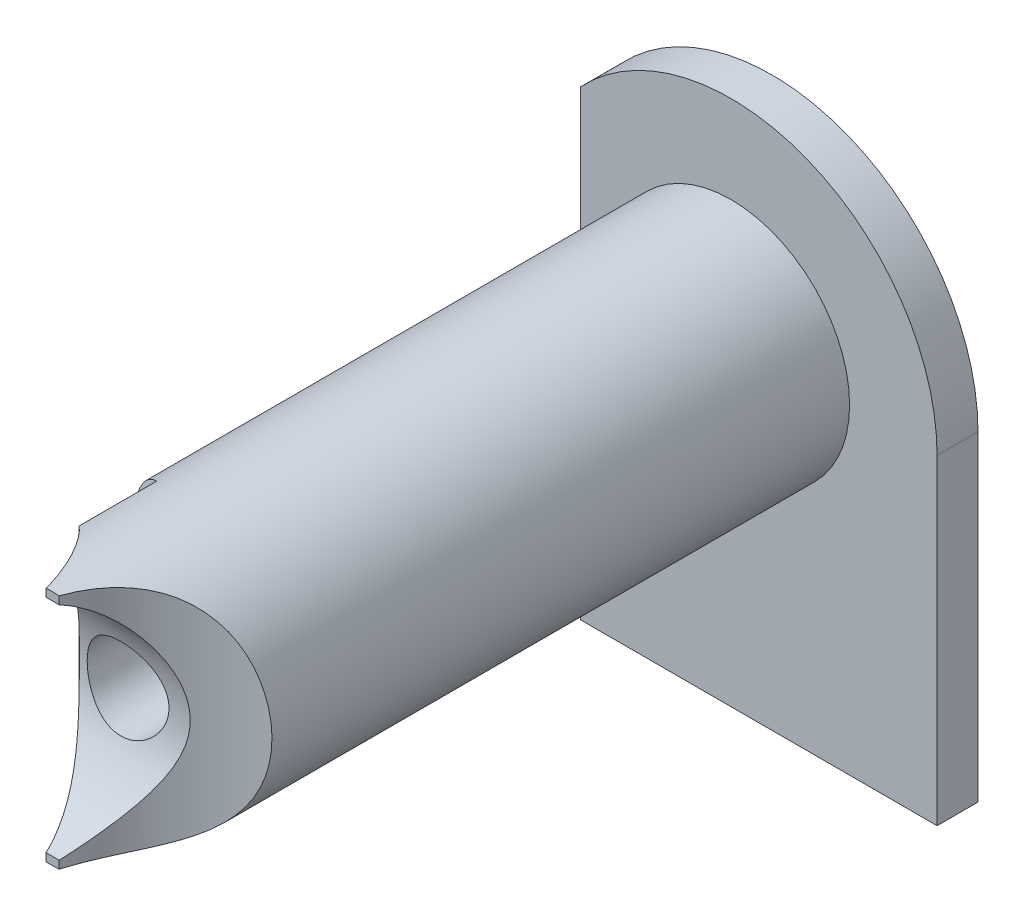
ISO-10303-21;
HEADER;
FILE_DESCRIPTION(('STEP AP214'),'2;1');
FILE_NAME('part.step','',(''),(''),'','','');
FILE_SCHEMA(('AUTOMOTIVE_DESIGN { 1 0 10303 214 1 1 1 1 }'));
ENDSEC;
DATA;
#1=APPLICATION_CONTEXT('core data for automotive mechanical design processes');
#2=APPLICATION_PROTOCOL_DEFINITION('international standard','automotive_design',2000,#1);
#3=PRODUCT_CONTEXT('',#1,'mechanical');
#4=PRODUCT('Part','Part','',(#3));
#5=PRODUCT_RELATED_PRODUCT_CATEGORY('part','',(#4));
#6=PRODUCT_DEFINITION_FORMATION('','',#4);
#7=PRODUCT_DEFINITION_CONTEXT('part definition',#1,'design');
#8=PRODUCT_DEFINITION('design','',#6,#7);
#9=PRODUCT_DEFINITION_SHAPE('','',#8);
#10=(LENGTH_UNIT() NAMED_UNIT(*) SI_UNIT(.MILLI.,.METRE.));
#11=(NAMED_UNIT(*) PLANE_ANGLE_UNIT() SI_UNIT($,.RADIAN.));
#12=(NAMED_UNIT(*) SI_UNIT($,.STERADIAN.) SOLID_ANGLE_UNIT());
#13=UNCERTAINTY_MEASURE_WITH_UNIT(LENGTH_MEASURE(1.E-05),#10,'distance_accuracy_value','');
#14=(GEOMETRIC_REPRESENTATION_CONTEXT(3) GLOBAL_UNCERTAINTY_ASSIGNED_CONTEXT((#13)) GLOBAL_UNIT_ASSIGNED_CONTEXT((#10,
#11,#12)) REPRESENTATION_CONTEXT('',''));
#15=CARTESIAN_POINT('',(0.,0.,0.));
#16=DIRECTION('',(0.,0.,1.));
#17=DIRECTION('',(1.,0.,0.));
#18=AXIS2_PLACEMENT_3D('',#15,#16,#17);
#19=CARTESIAN_POINT('',(0.,0.,0.));
#20=DIRECTION('',(0.,0.,1.));
#21=DIRECTION('',(1.,0.,0.));
#22=AXIS2_PLACEMENT_3D('',#19,#20,#21);
#23=CYLINDRICAL_SURFACE('',#22,2.2);
#24=CARTESIAN_POINT('',(0.,0.,1.39999999998963));
#25=DIRECTION('',(0.,0.,-1.));
#26=DIRECTION('',(1.,0.,0.));
#27=AXIS2_PLACEMENT_3D('',#24,#25,#26);
#28=CIRCLE('',#27,2.20000000007303);
#29=CARTESIAN_POINT('',(2.20000000007303,0.,1.39999999998963));
#30=VERTEX_POINT('',#29);
#31=EDGE_CURVE('E156',#30,#30,#28,.T.);
#32=ORIENTED_EDGE('',*,*,#31,.T.);
#33=EDGE_LOOP('',(#32));
#34=FACE_BOUND('',#33,.T.);
#35=CARTESIAN_POINT('',(0.,0.,16.));
#36=DIRECTION('',(0.,0.,1.));
#37=DIRECTION('',(1.,0.,0.));
#38=AXIS2_PLACEMENT_3D('',#35,#36,#37);
#39=CIRCLE('',#38,2.2);
#40=CARTESIAN_POINT('',(2.2,0.,16.));
#41=VERTEX_POINT('',#40);
#42=EDGE_CURVE('E19',#41,#41,#39,.T.);
#43=ORIENTED_EDGE('',*,*,#42,.T.);
#44=EDGE_LOOP('',(#43));
#45=FACE_BOUND('',#44,.T.);
#46=ADVANCED_FACE('F16',(#34,#45),#23,.F.);
#47=CARTESIAN_POINT('',(0.,0.,16.));
#48=DIRECTION('',(0.,0.,1.));
#49=DIRECTION('',(1.,0.,0.));
#50=AXIS2_PLACEMENT_3D('',#47,#48,#49);
#51=PLANE('',#50);
#52=CARTESIAN_POINT('',(0.,0.,16.));
#53=DIRECTION('',(0.,0.,-1.));
#54=DIRECTION('',(-1.,0.,0.));
#55=AXIS2_PLACEMENT_3D('',#52,#53,#54);
#56=CIRCLE('',#55,1.25);
#57=CARTESIAN_POINT('',(-1.25,0.,16.));
#58=VERTEX_POINT('',#57);
#59=EDGE_CURVE('E159',#58,#58,#56,.F.);
#60=ORIENTED_EDGE('',*,*,#59,.T.);
#61=EDGE_LOOP('',(#60));
#62=FACE_BOUND('',#61,.T.);
#63=ORIENTED_EDGE('',*,*,#42,.F.);
#64=EDGE_LOOP('',(#63));
#65=FACE_BOUND('',#64,.T.);
#66=ADVANCED_FACE('F246',(#62,#65),#51,.F.);
#67=CARTESIAN_POINT('',(0.,0.,5.6843418860808E-11));
#68=DIRECTION('',(0.,0.,-1.));
#69=DIRECTION('',(-1.,0.,0.));
#70=AXIS2_PLACEMENT_3D('',#67,#68,#69);
#71=CONICAL_SURFACE('',#70,3.60000000000582,0.785398163397448);
#72=CARTESIAN_POINT('',(0.,0.,5.6843418860808E-11));
#73=DIRECTION('',(0.,0.,-1.));
#74=DIRECTION('',(-1.,0.,0.));
#75=AXIS2_PLACEMENT_3D('',#72,#73,#74);
#76=CIRCLE('',#75,3.60000000000582);
#77=CARTESIAN_POINT('',(-3.60000000000582,0.,5.6843418860808E-11));
#78=VERTEX_POINT('',#77);
#79=EDGE_CURVE('E141',#78,#78,#76,.T.);
#80=ORIENTED_EDGE('',*,*,#79,.T.);
#81=EDGE_LOOP('',(#80));
#82=FACE_BOUND('',#81,.T.);
#83=ORIENTED_EDGE('',*,*,#31,.F.);
#84=EDGE_LOOP('',(#83));
#85=FACE_BOUND('',#84,.T.);
#86=ADVANCED_FACE('F243',(#82,#85),#71,.F.);
#87=CARTESIAN_POINT('',(0.,0.,22.));
#88=DIRECTION('',(0.,0.,-1.));
#89=DIRECTION('',(-1.,0.,0.));
#90=AXIS2_PLACEMENT_3D('',#87,#88,#89);
#91=CYLINDRICAL_SURFACE('',#90,1.25);
#92=ORIENTED_EDGE('',*,*,#59,.F.);
#93=EDGE_LOOP('',(#92));
#94=FACE_BOUND('',#93,.T.);
#95=CARTESIAN_POINT('',(0.,1.25,19.8978436713564));
#96=CARTESIAN_POINT('',(-0.0679244800988479,1.25000086796655,19.8978443860581));
#97=CARTESIAN_POINT('',(-0.135842933793422,1.24444487050265,19.8957833530326));
#98=CARTESIAN_POINT('',(-0.269657575517761,1.22244980443124,19.8878088146394));
#99=CARTESIAN_POINT('',(-0.335553550477822,1.20600959325332,19.881894904817));
#100=CARTESIAN_POINT('',(-0.463360945324166,1.16290062835713,19.8669627047752));
#101=CARTESIAN_POINT('',(-0.525280337329512,1.13625313605356,19.8579508713991));
#102=CARTESIAN_POINT('',(-0.643791152118634,1.07355949262704,19.837847899369));
#103=CARTESIAN_POINT('',(-0.700381263501824,1.03751103634852,19.8267562509232));
#104=CARTESIAN_POINT('',(-0.809007347203373,0.955414579593332,19.8032203151329));
#105=CARTESIAN_POINT('',(-0.860786737513333,0.909037171034703,19.7907405403483));
#106=CARTESIAN_POINT('',(-0.956009639956803,0.808301154152748,19.766133329688));
#107=CARTESIAN_POINT('',(-0.999451698829062,0.753941157312231,19.7540059555505));
#108=CARTESIAN_POINT('',(-1.07795080960379,0.636886846726681,19.7310560526318));
#109=CARTESIAN_POINT('',(-1.11273621101807,0.574000420441734,19.7202800833318));
#110=CARTESIAN_POINT('',(-1.17113157115788,0.442831894091509,19.701667612356));
#111=CARTESIAN_POINT('',(-1.19474477999888,0.374551369983123,19.6938302559428));
#112=CARTESIAN_POINT('',(-1.2292470985948,0.237225190263073,19.6822295733358));
#113=CARTESIAN_POINT('',(-1.24057636261075,0.16830221771519,19.678325699712));
#114=CARTESIAN_POINT('',(-1.25159174102537,0.0294302907076386,19.6745314082797));
#115=CARTESIAN_POINT('',(-1.25128107389356,-0.0405183747982762,19.6746398810475));
#116=CARTESIAN_POINT('',(-1.23929822635911,-0.176329706572923,19.6787644389511));
#117=CARTESIAN_POINT('',(-1.22810474950267,-0.242240442098288,19.6826158787156));
#118=CARTESIAN_POINT('',(-1.19546944676986,-0.371182833738493,19.6935843230476));
#119=CARTESIAN_POINT('',(-1.17402691447761,-0.434214291071031,19.7007015527082));
#120=CARTESIAN_POINT('',(-1.12123918718876,-0.556620898055839,19.7176047832685));
#121=CARTESIAN_POINT('',(-1.08976314845211,-0.61593458665218,19.7274257985207));
#122=CARTESIAN_POINT('',(-1.01791174395466,-0.728575193755699,19.7487221659081));
#123=CARTESIAN_POINT('',(-0.977533779711246,-0.781900357331002,19.760198000748));
#124=CARTESIAN_POINT('',(-0.886641267506775,-0.883891513879295,19.7842833845292));
#125=CARTESIAN_POINT('',(-0.8357188282652,-0.932187934326669,19.7969209237661));
#126=CARTESIAN_POINT('',(-0.726397770707999,-1.01968084494647,19.8214254442492));
#127=CARTESIAN_POINT('',(-0.66799781853852,-1.05887570804644,19.8332922874464));
#128=CARTESIAN_POINT('',(-0.544129319151011,-1.12761669610327,19.8550717885169));
#129=CARTESIAN_POINT('',(-0.478561028872439,-1.15699504567843,19.8649494215703));
#130=CARTESIAN_POINT('',(-0.342979508718129,-1.20416381175255,19.8812278361306));
#131=CARTESIAN_POINT('',(-0.272968324636218,-1.22195951975829,19.8876302050829));
#132=CARTESIAN_POINT('',(-0.134090244649073,-1.24468095728118,19.8958697798906));
#133=CARTESIAN_POINT('',(-0.065329920620134,-1.25018382842495,19.897911498419));
#134=CARTESIAN_POINT('',(0.0721472888909036,-1.24980687642328,19.8977724226291));
#135=CARTESIAN_POINT('',(0.140864180299875,-1.24392932217262,19.8955924699776));
#136=CARTESIAN_POINT('',(0.273588572060938,-1.22147843143933,19.8874606833778));
#137=CARTESIAN_POINT('',(0.337675880725648,-1.20531827758905,19.8816547123743));
#138=CARTESIAN_POINT('',(0.462212228709352,-1.16326336828004,19.8670890804522));
#139=CARTESIAN_POINT('',(0.522660591188891,-1.13736680831216,19.8583288720372));
#140=CARTESIAN_POINT('',(0.640446216933245,-1.07559215860392,19.838479568612));
#141=CARTESIAN_POINT('',(0.69761176173089,-1.03940914354079,19.8273223701759));
#142=CARTESIAN_POINT('',(0.80526753647923,-0.958428141299509,19.8040632405038));
#143=CARTESIAN_POINT('',(0.855755651824465,-0.913627436046384,19.7919610119165));
#144=CARTESIAN_POINT('',(0.951354636496911,-0.813903923966883,19.7674102209685));
#145=CARTESIAN_POINT('',(0.996046346298425,-0.758574360910484,19.7549766337844));
#146=CARTESIAN_POINT('',(1.07554433194323,-0.640894131740424,19.7317831377029));
#147=CARTESIAN_POINT('',(1.11035087446422,-0.578543655097271,19.7210231836585));
#148=CARTESIAN_POINT('',(1.16878954928363,-0.448840953661153,19.7024299594336));
#149=CARTESIAN_POINT('',(1.19248711414304,-0.381520791166974,19.6945796103623));
#150=CARTESIAN_POINT('',(1.22811609579468,-0.243523290194956,19.6826186057761));
#151=CARTESIAN_POINT('',(1.24005211170052,-0.172847275295524,19.6785064885507));
#152=CARTESIAN_POINT('',(1.25138151325684,-0.0339646408415084,19.6746036325415));
#153=CARTESIAN_POINT('',(1.25137467368776,0.0341877486817581,19.674606249536));
#154=CARTESIAN_POINT('',(1.24031579157669,0.169475270760439,19.6784153912838));
#155=CARTESIAN_POINT('',(1.22926475952144,0.236610495810688,19.6822215680309));
#156=CARTESIAN_POINT('',(1.19683703997043,0.366739710113705,19.6931287184379));
#157=CARTESIAN_POINT('',(1.17565097385536,0.429786678559307,19.7001687752202));
#158=CARTESIAN_POINT('',(1.12373438064327,0.551450801547351,19.7168175975318));
#159=CARTESIAN_POINT('',(1.09300209006457,0.610067135125508,19.7264268376227));
#160=CARTESIAN_POINT('',(1.02150459005946,0.72367495976101,19.7476932825457));
#161=CARTESIAN_POINT('',(0.980398025175527,0.7784393292172,19.7594152000636));
#162=CARTESIAN_POINT('',(0.889887080709123,0.880486113485907,19.7834460652259));
#163=CARTESIAN_POINT('',(0.840479956379136,0.92776604334017,19.7957552060804));
#164=CARTESIAN_POINT('',(0.732239723477382,1.01557160693506,19.8202070041386));
#165=CARTESIAN_POINT('',(0.673093154621859,1.05572043580642,19.8323198618095));
#166=CARTESIAN_POINT('',(0.548510903251562,1.1254910455994,19.8543727114239));
#167=CARTESIAN_POINT('',(0.483076273882375,1.15511458544152,19.8643130663155));
#168=CARTESIAN_POINT('',(0.349091955921276,1.20232010017759,19.8805798993618));
#169=CARTESIAN_POINT('',(0.280634096711385,1.22013735783424,19.8869765451443));
#170=CARTESIAN_POINT('',(0.141448006087147,1.24397438925929,19.8956071887561));
#171=CARTESIAN_POINT('',(0.0707207366450371,1.24999909630175,19.8978429272324));
#172=CARTESIAN_POINT('',(0.,1.25,19.8978436713564));
#173=B_SPLINE_CURVE_WITH_KNOTS('',3,(#95,#96,#97,#98,#99,#100,#101,#102,#103,#104,#105,#106,
#107,#108,#109,#110,#111,#112,#113,#114,#115,#116,#117,#118,#119,#120,#121,#122,#123,#124,#125,
#126,#127,#128,#129,#130,#131,#132,#133,#134,#135,#136,#137,#138,#139,#140,#141,#142,#143,#144,
#145,#146,#147,#148,#149,#150,#151,#152,#153,#154,#155,#156,#157,#158,#159,#160,#161,#162,#163,
#164,#165,#166,#167,#168,#169,#170,#171,#172),.UNSPECIFIED.,.T.,.F.,(4,2,2,2,2,2,2,2,2,2,2,2,2,
2,2,2,2,2,2,2,2,2,2,2,2,2,2,2,2,2,2,2,2,2,2,2,2,2,4),(0.,0.203511139491736,0.407043645954993,
0.610154486559866,0.813315177694251,1.02423741599598,1.23519638634716,1.45211698254992,
1.66897443527126,1.87777478156237,2.08651739447182,2.28647500077357,2.48644639113581,
2.68914025789089,2.89189336974925,3.1048510057456,3.31784668261728,3.53431589010938,
3.75068613453101,3.95666316344897,4.16259913132811,4.36074177300059,4.55892115580724,
4.7637300924964,4.96860373347955,5.18418899640245,5.3997684428082,5.61406164396909,
5.8282710168564,6.03172303865505,6.23515644734529,6.43490568970265,6.63469185386391,
6.84218649561138,7.04974988518443,7.26621834146235,7.4826506058514,7.69462841418539,
7.90651752514187),.UNSPECIFIED.);
#174=CARTESIAN_POINT('',(0.,1.25,19.8978436713564));
#175=VERTEX_POINT('',#174);
#176=EDGE_CURVE('E140',#175,#175,#173,.T.);
#177=ORIENTED_EDGE('',*,*,#176,.T.);
#178=EDGE_LOOP('',(#177));
#179=FACE_BOUND('',#178,.T.);
#180=ADVANCED_FACE('F239',(#94,#179),#91,.F.);
#181=CARTESIAN_POINT('',(0.,0.,0.));
#182=DIRECTION('',(0.,0.,1.));
#183=DIRECTION('',(1.,0.,0.));
#184=AXIS2_PLACEMENT_3D('',#181,#182,#183);
#185=PLANE('',#184);
#186=ORIENTED_EDGE('',*,*,#79,.F.);
#187=EDGE_LOOP('',(#186));
#188=FACE_BOUND('',#187,.T.);
#189=DIRECTION('',(0.,1.,0.));
#190=VECTOR('',#189,1.);
#191=CARTESIAN_POINT('',(6.3,-9.8,0.));
#192=LINE('',#191,#190);
#193=CARTESIAN_POINT('',(6.3,-9.8,0.));
#194=VERTEX_POINT('',#193);
#195=CARTESIAN_POINT('',(6.3,0.,0.));
#196=VERTEX_POINT('',#195);
#197=EDGE_CURVE('E90',#194,#196,#192,.T.);
#198=ORIENTED_EDGE('',*,*,#197,.F.);
#199=DIRECTION('',(1.,0.,0.));
#200=VECTOR('',#199,1.);
#201=CARTESIAN_POINT('',(-4.6,-9.8,0.));
#202=LINE('',#201,#200);
#203=CARTESIAN_POINT('',(-4.6,-9.8,0.));
#204=VERTEX_POINT('',#203);
#205=EDGE_CURVE('E106',#204,#194,#202,.T.);
#206=ORIENTED_EDGE('',*,*,#205,.F.);
#207=DIRECTION('',(0.,-1.,0.));
#208=VECTOR('',#207,1.);
#209=CARTESIAN_POINT('',(-4.6,4.30464865000618,0.));
#210=LINE('',#209,#208);
#211=CARTESIAN_POINT('',(-4.6,4.30464865000618,0.));
#212=VERTEX_POINT('',#211);
#213=EDGE_CURVE('E137',#212,#204,#210,.T.);
#214=ORIENTED_EDGE('',*,*,#213,.F.);
#215=CARTESIAN_POINT('',(0.,0.,0.));
#216=DIRECTION('',(0.,0.,1.));
#217=DIRECTION('',(1.,0.,0.));
#218=AXIS2_PLACEMENT_3D('',#215,#216,#217);
#219=CIRCLE('',#218,6.3);
#220=EDGE_CURVE('E86',#196,#212,#219,.T.);
#221=ORIENTED_EDGE('',*,*,#220,.F.);
#222=EDGE_LOOP('',(#198,#206,#214,#221));
#223=FACE_BOUND('',#222,.T.);
#224=ADVANCED_FACE('F229',(#188,#223),#185,.F.);
#225=CARTESIAN_POINT('',(0.,0.,23.2935034352874));
#226=DIRECTION('',(1.,0.,0.));
#227=DIRECTION('',(0.,0.,-1.));
#228=AXIS2_PLACEMENT_3D('',#225,#226,#227);
#229=CYLINDRICAL_SURFACE('',#228,3.61842579478704);
#230=ORIENTED_EDGE('',*,*,#176,.F.);
#231=EDGE_LOOP('',(#230));
#232=FACE_BOUND('',#231,.T.);
#233=DIRECTION('',(1.,0.,0.));
#234=VECTOR('',#233,1.);
#235=CARTESIAN_POINT('',(0.,3.37932746197818,22.));
#236=LINE('',#235,#234);
#237=CARTESIAN_POINT('',(-0.184638075837882,3.37932746197818,22.));
#238=VERTEX_POINT('',#237);
#239=CARTESIAN_POINT('',(0.218219539958672,3.37932746197818,22.));
#240=VERTEX_POINT('',#239);
#241=EDGE_CURVE('E142',#238,#240,#236,.T.);
#242=ORIENTED_EDGE('',*,*,#241,.F.);
#243=CARTESIAN_POINT('',(-0.184638075837882,3.37932746197818,22.));
#244=CARTESIAN_POINT('',(-0.211156231165822,3.34149870850248,21.9011564537886));
#245=CARTESIAN_POINT('',(-0.240102435210036,3.29956334294519,21.804599611213));
#246=CARTESIAN_POINT('',(-0.302028706600854,3.2081121569774,21.6166244880252));
#247=CARTESIAN_POINT('',(-0.335004563774821,3.15860423496916,21.5252009874701));
#248=CARTESIAN_POINT('',(-0.404101696405193,3.05275051746999,21.3481697718626));
#249=CARTESIAN_POINT('',(-0.440211237197433,2.99642994547444,21.2625423295464));
#250=CARTESIAN_POINT('',(-0.514855657187254,2.877318330208,21.0970419071478));
#251=CARTESIAN_POINT('',(-0.553391169868868,2.81452559413697,21.0171704418753));
#252=CARTESIAN_POINT('',(-0.671071326812881,2.61764283811563,20.7871974398669));
#253=CARTESIAN_POINT('',(-0.752632892515098,2.47453761652903,20.6458931668224));
#254=CARTESIAN_POINT('',(-0.91514122800787,2.16661334121827,20.3884801926924));
#255=CARTESIAN_POINT('',(-0.996087029222736,2.00176549151058,20.2724054551357));
#256=CARTESIAN_POINT('',(-1.13854217466289,1.67541983500405,20.0815381400047));
#257=CARTESIAN_POINT('',(-1.2012012753984,1.51645563765253,20.0032924300049));
#258=CARTESIAN_POINT('',(-1.31272831562854,1.18472090812666,19.8698730102282));
#259=CARTESIAN_POINT('',(-1.36162706865452,1.0119823531467,19.8146476153272));
#260=CARTESIAN_POINT('',(-1.43108421837339,0.688496535683084,19.7380477448507));
#261=CARTESIAN_POINT('',(-1.45520583678599,0.539567696935899,19.7123090323962));
#262=CARTESIAN_POINT('',(-1.48590572805914,0.237910065879286,19.6797308912269));
#263=CARTESIAN_POINT('',(-1.49250140019073,0.0851851943634162,19.6728727181946));
#264=CARTESIAN_POINT('',(-1.48711347849168,-0.219638538059778,19.6785316728409));
#265=CARTESIAN_POINT('',(-1.47511992170577,-0.371737019438807,19.6910591903351));
#266=CARTESIAN_POINT('',(-1.43442357218647,-0.67100977546266,19.7346139908888));
#267=CARTESIAN_POINT('',(-1.4056997864648,-0.81817761737474,19.7656645176927));
#268=CARTESIAN_POINT('',(-1.32503908738958,-1.14628720981243,19.8560875352559));
#269=CARTESIAN_POINT('',(-1.26877988168136,-1.32459779253885,19.9210717458046));
#270=CARTESIAN_POINT('',(-1.14340801119706,-1.66541071910351,20.075649049543));
#271=CARTESIAN_POINT('',(-1.07426888421057,-1.82787944915997,20.1652929910027));
#272=CARTESIAN_POINT('',(-0.929036379858701,-2.13918185944321,20.3690728991352));
#273=CARTESIAN_POINT('',(-0.852820661460019,-2.28762171998165,20.4837192110942));
#274=CARTESIAN_POINT('',(-0.701382057343645,-2.5651243495847,20.7345935165106));
#275=CARTESIAN_POINT('',(-0.626157563676736,-2.69422331116887,20.8707801939833));
#276=CARTESIAN_POINT('',(-0.518621597069257,-2.87119991529148,21.0894426414053));
#277=CARTESIAN_POINT('',(-0.483831102446247,-2.92715907171335,21.1642913146299));
#278=CARTESIAN_POINT('',(-0.416464846072824,-3.03352434479586,21.3187815726451));
#279=CARTESIAN_POINT('',(-0.383888590896951,-3.08393170019425,21.3984220821068));
#280=CARTESIAN_POINT('',(-0.321456204380259,-3.17898141683488,21.5625759173482));
#281=CARTESIAN_POINT('',(-0.291611547947464,-3.2235997601302,21.6471075640776));
#282=CARTESIAN_POINT('',(-0.235373748885312,-3.30641251909317,21.82045054339));
#283=CARTESIAN_POINT('',(-0.208983543288508,-3.34460147618006,21.9092654309972));
#284=CARTESIAN_POINT('',(-0.184638075837881,-3.37932746197819,22.));
#285=B_SPLINE_CURVE_WITH_KNOTS('',3,(#243,#244,#245,#246,#247,#248,#249,#250,#251,#252,#253,
#254,#255,#256,#257,#258,#259,#260,#261,#262,#263,#264,#265,#266,#267,#268,#269,#270,#271,#272,
#273,#274,#275,#276,#277,#278,#279,#280,#281,#282,#283,#284),.UNSPECIFIED.,.F.,.F.,(4,2,2,2,2,2,
2,2,2,2,2,2,2,2,2,2,2,2,2,2,4),(0.,0.327108060363067,0.653877234984881,0.979471606352299,
1.3051513543538,1.95341331613028,2.60254262412977,3.16433156329025,3.72485229241627,
4.182013982662,4.63872164565754,5.09567416720481,5.55320130900164,6.14384287358508,
6.73571158795343,7.34103221298297,7.94520556295312,8.24412659479571,8.54298079460886,
8.84303774768608,9.14334817979042),.UNSPECIFIED.);
#286=CARTESIAN_POINT('',(-0.184638075837881,-3.37932746197818,22.));
#287=VERTEX_POINT('',#286);
#288=EDGE_CURVE('E145',#238,#287,#285,.T.);
#289=ORIENTED_EDGE('',*,*,#288,.T.);
#290=DIRECTION('',(1.,0.,0.));
#291=VECTOR('',#290,1.);
#292=CARTESIAN_POINT('',(0.,-3.37932746197818,22.));
#293=LINE('',#292,#291);
#294=CARTESIAN_POINT('',(0.218219539958672,-3.37932746197818,22.));
#295=VERTEX_POINT('',#294);
#296=EDGE_CURVE('E138',#295,#287,#293,.F.);
#297=ORIENTED_EDGE('',*,*,#296,.F.);
#298=CARTESIAN_POINT('',(0.218219539958672,-3.37932746197818,22.));
#299=CARTESIAN_POINT('',(0.249955595366505,-3.34129490718428,21.9006260992964));
#300=CARTESIAN_POINT('',(0.284622608844999,-3.29921371335805,21.8038249336452));
#301=CARTESIAN_POINT('',(0.358874569765495,-3.20773227207749,21.6158999905739));
#302=CARTESIAN_POINT('',(0.398452521957451,-3.15834241634905,21.5247684090622));
#303=CARTESIAN_POINT('',(0.481412109280792,-3.05324603464561,21.3489932261304));
#304=CARTESIAN_POINT('',(0.524767948097167,-2.99758168690944,21.2643120424699));
#305=CARTESIAN_POINT('',(0.614630027769926,-2.88026548643591,21.1009731962136));
#306=CARTESIAN_POINT('',(0.661137389969564,-2.81861149910588,21.0223176990502));
#307=CARTESIAN_POINT('',(0.803537182970882,-2.62617949665099,20.7964695843413));
#308=CARTESIAN_POINT('',(0.902861324595828,-2.4872440652626,20.6582654552818));
#309=CARTESIAN_POINT('',(1.10382943480736,-2.18967908156275,20.4062047350761));
#310=CARTESIAN_POINT('',(1.20547857075844,-2.03100128134004,20.2924097196792));
#311=CARTESIAN_POINT('',(1.38744824926844,-1.71969183503718,20.1054786092747));
#312=CARTESIAN_POINT('',(1.46868125810829,-1.56972223376261,20.0288042654267));
#313=CARTESIAN_POINT('',(1.61859507468528,-1.25534052987597,19.8955423392714));
#314=CARTESIAN_POINT('',(1.68730843145521,-1.09096757227611,19.8389022990206));
#315=CARTESIAN_POINT('',(1.78407116856308,-0.799205821324052,19.7622552275132));
#316=CARTESIAN_POINT('',(1.81813629235307,-0.675412440235208,19.7363604986931));
#317=CARTESIAN_POINT('',(1.8699638889713,-0.422557817866898,19.69757133253));
#318=CARTESIAN_POINT('',(1.88776080128269,-0.293508311929657,19.6846494262472));
#319=CARTESIAN_POINT('',(1.9039713158961,-0.0327035544222784,19.6728618199396));
#320=CARTESIAN_POINT('',(1.90226877130446,0.0990632387624701,19.6740803467978));
#321=CARTESIAN_POINT('',(1.87953775332483,0.360062829307596,19.6906537282976));
#322=CARTESIAN_POINT('',(1.85848336601226,0.489291991489006,19.7060275382334));
#323=CARTESIAN_POINT('',(1.79340159777166,0.773832864086648,19.7551384332685));
#324=CARTESIAN_POINT('',(1.74490124501591,0.927444496541583,19.7925446470255));
#325=CARTESIAN_POINT('',(1.63224816655548,1.22347710666229,19.8846461611147));
#326=CARTESIAN_POINT('',(1.56804631713182,1.3658610718166,19.9393958842611));
#327=CARTESIAN_POINT('',(1.44859049514985,1.60457570668872,20.0483690565294));
#328=CARTESIAN_POINT('',(1.39519091495397,1.70343437789258,20.0992111252219));
#329=CARTESIAN_POINT('',(1.28581693924228,1.89508020958081,20.209044778376));
#330=CARTESIAN_POINT('',(1.22984131203267,1.98786441320282,20.2680402888479));
#331=CARTESIAN_POINT('',(1.11706053040588,2.16741089926434,20.3939595772521));
#332=CARTESIAN_POINT('',(1.06025509651569,2.25417109349274,20.4608860829024));
#333=CARTESIAN_POINT('',(0.947277450181522,2.42150527115037,20.6025285263854));
#334=CARTESIAN_POINT('',(0.891105375481016,2.50207793023455,20.6772461237552));
#335=CARTESIAN_POINT('',(0.738883420718191,2.71528114483798,20.8939750580893));
#336=CARTESIAN_POINT('',(0.644761687038023,2.84126157853707,21.0441856505552));
#337=CARTESIAN_POINT('',(0.513224865558886,3.01244722593785,21.2865363692757));
#338=CARTESIAN_POINT('',(0.471037092150247,3.06648426251062,21.3700355919397));
#339=CARTESIAN_POINT('',(0.390589747786621,3.16818347863871,21.5426088703919));
#340=CARTESIAN_POINT('',(0.352327503413965,3.21585000351376,21.6316790647196));
#341=CARTESIAN_POINT('',(0.298874623312115,3.28162373663356,21.7682373781404));
#342=CARTESIAN_POINT('',(0.281872812231806,3.30240414888444,21.8137549004021));
#343=CARTESIAN_POINT('',(0.249100289691648,3.34220484205815,21.9059898113939));
#344=CARTESIAN_POINT('',(0.233329651090148,3.36122501882607,21.9527072709168));
#345=CARTESIAN_POINT('',(0.218219539958636,3.37932746197831,21.9999999999999));
#346=B_SPLINE_CURVE_WITH_KNOTS('',3,(#298,#299,#300,#301,#302,#303,#304,#305,#306,#307,#308,
#309,#310,#311,#312,#313,#314,#315,#316,#317,#318,#319,#320,#321,#322,#323,#324,#325,#326,#327,
#328,#329,#330,#331,#332,#333,#334,#335,#336,#337,#338,#339,#340,#341,#342,#343,#344,#345),
.UNSPECIFIED.,.F.,.F.,(4,2,2,2,2,2,2,2,2,2,2,2,2,2,2,2,2,2,2,2,2,2,2,4),(0.,0.332850360488146,
0.665231930102698,0.995499245862366,1.32588469737193,1.98240202844311,2.64055653949701,
3.20000818888788,3.75798392959356,4.14950264865803,4.54019059773311,4.93320685141966,
5.32675015852905,5.82013096474709,6.31507556536427,6.6846162396128,7.0543354775105,
7.42418224452947,7.79410795210199,8.44346251961739,8.76727141479949,9.09085830055256,
9.24934826830561,9.4078476080825),.UNSPECIFIED.);
#347=EDGE_CURVE('E218',#295,#240,#346,.T.);
#348=ORIENTED_EDGE('',*,*,#347,.T.);
#349=EDGE_LOOP('',(#242,#289,#297,#348));
#350=FACE_BOUND('',#349,.T.);
#351=ADVANCED_FACE('F223',(#232,#350),#229,.F.);
#352=CARTESIAN_POINT('',(0.,0.,0.));
#353=DIRECTION('',(0.,0.,1.));
#354=DIRECTION('',(1.,0.,0.));
#355=AXIS2_PLACEMENT_3D('',#352,#353,#354);
#356=CYLINDRICAL_SURFACE('',#355,6.3);
#357=CARTESIAN_POINT('',(0.,0.,1.25));
#358=DIRECTION('',(0.,0.,1.));
#359=DIRECTION('',(1.,0.,0.));
#360=AXIS2_PLACEMENT_3D('',#357,#358,#359);
#361=CIRCLE('',#360,6.3);
#362=CARTESIAN_POINT('',(6.3,0.,1.25));
#363=VERTEX_POINT('',#362);
#364=CARTESIAN_POINT('',(-4.6,4.30464865000618,1.25));
#365=VERTEX_POINT('',#364);
#366=EDGE_CURVE('E123',#363,#365,#361,.T.);
#367=ORIENTED_EDGE('',*,*,#366,.F.);
#368=DIRECTION('',(0.,0.,1.));
#369=VECTOR('',#368,1.);
#370=CARTESIAN_POINT('',(6.3,0.,0.));
#371=LINE('',#370,#369);
#372=EDGE_CURVE('E109',#196,#363,#371,.T.);
#373=ORIENTED_EDGE('',*,*,#372,.F.);
#374=ORIENTED_EDGE('',*,*,#220,.T.);
#375=DIRECTION('',(0.,0.,1.));
#376=VECTOR('',#375,1.);
#377=CARTESIAN_POINT('',(-4.6,4.30464865000618,0.));
#378=LINE('',#377,#376);
#379=EDGE_CURVE('E134',#365,#212,#378,.F.);
#380=ORIENTED_EDGE('',*,*,#379,.F.);
#381=EDGE_LOOP('',(#367,#373,#374,#380));
#382=FACE_BOUND('',#381,.T.);
#383=ADVANCED_FACE('F228',(#382),#356,.T.);
#384=CARTESIAN_POINT('',(-4.6,4.30464865000618,0.));
#385=DIRECTION('',(-1.,0.,0.));
#386=DIRECTION('',(0.,-1.,0.));
#387=AXIS2_PLACEMENT_3D('',#384,#385,#386);
#388=PLANE('',#387);
#389=DIRECTION('',(0.,1.,0.));
#390=VECTOR('',#389,1.);
#391=CARTESIAN_POINT('',(-4.6,-3.08264576191558,1.25));
#392=LINE('',#391,#390);
#393=CARTESIAN_POINT('',(-4.6,-9.8,1.25));
#394=VERTEX_POINT('',#393);
#395=EDGE_CURVE('E121',#365,#394,#392,.F.);
#396=ORIENTED_EDGE('',*,*,#395,.F.);
#397=ORIENTED_EDGE('',*,*,#379,.T.);
#398=ORIENTED_EDGE('',*,*,#213,.T.);
#399=DIRECTION('',(0.,0.,1.));
#400=VECTOR('',#399,1.);
#401=CARTESIAN_POINT('',(-4.6,-9.8,0.));
#402=LINE('',#401,#400);
#403=EDGE_CURVE('E130',#394,#204,#402,.F.);
#404=ORIENTED_EDGE('',*,*,#403,.F.);
#405=EDGE_LOOP('',(#396,#397,#398,#404));
#406=FACE_BOUND('',#405,.T.);
#407=ADVANCED_FACE('F282',(#406),#388,.T.);
#408=CARTESIAN_POINT('',(-4.6,-9.8,0.));
#409=DIRECTION('',(0.,-1.,0.));
#410=DIRECTION('',(1.,0.,0.));
#411=AXIS2_PLACEMENT_3D('',#408,#409,#410);
#412=PLANE('',#411);
#413=DIRECTION('',(1.,0.,0.));
#414=VECTOR('',#413,1.);
#415=CARTESIAN_POINT('',(0.574107153339075,-9.8,1.25));
#416=LINE('',#415,#414);
#417=CARTESIAN_POINT('',(6.3,-9.8,1.25));
#418=VERTEX_POINT('',#417);
#419=EDGE_CURVE('E104',#394,#418,#416,.T.);
#420=ORIENTED_EDGE('',*,*,#419,.F.);
#421=ORIENTED_EDGE('',*,*,#403,.T.);
#422=ORIENTED_EDGE('',*,*,#205,.T.);
#423=DIRECTION('',(0.,0.,1.));
#424=VECTOR('',#423,1.);
#425=CARTESIAN_POINT('',(6.3,-9.8,0.));
#426=LINE('',#425,#424);
#427=EDGE_CURVE('E99',#418,#194,#426,.F.);
#428=ORIENTED_EDGE('',*,*,#427,.F.);
#429=EDGE_LOOP('',(#420,#421,#422,#428));
#430=FACE_BOUND('',#429,.T.);
#431=ADVANCED_FACE('F101',(#430),#412,.T.);
#432=CARTESIAN_POINT('',(6.3,-9.8,0.));
#433=DIRECTION('',(1.,0.,0.));
#434=DIRECTION('',(0.,1.,0.));
#435=AXIS2_PLACEMENT_3D('',#432,#433,#434);
#436=PLANE('',#435);
#437=DIRECTION('',(0.,1.,0.));
#438=VECTOR('',#437,1.);
#439=CARTESIAN_POINT('',(6.3,-3.08264576191558,1.25));
#440=LINE('',#439,#438);
#441=EDGE_CURVE('E113',#418,#363,#440,.T.);
#442=ORIENTED_EDGE('',*,*,#441,.F.);
#443=ORIENTED_EDGE('',*,*,#427,.T.);
#444=ORIENTED_EDGE('',*,*,#197,.T.);
#445=ORIENTED_EDGE('',*,*,#372,.T.);
#446=EDGE_LOOP('',(#442,#443,#444,#445));
#447=FACE_BOUND('',#446,.T.);
#448=ADVANCED_FACE('F114',(#447),#436,.T.);
#449=CARTESIAN_POINT('',(-1.8,0.,17.));
#450=DIRECTION('',(0.5,0.,-0.866025403784439));
#451=DIRECTION('',(-0.866025403784439,0.,-0.5));
#452=AXIS2_PLACEMENT_3D('',#449,#450,#451);
#453=PLANE('',#452);
#454=DIRECTION('',(0.,1.,0.));
#455=VECTOR('',#454,1.);
#456=CARTESIAN_POINT('',(-1.8,0.,17.));
#457=LINE('',#456,#455);
#458=CARTESIAN_POINT('',(-1.8,-3.14652586196268,17.));
#459=VERTEX_POINT('',#458);
#460=CARTESIAN_POINT('',(-1.8,3.14652586196268,17.));
#461=VERTEX_POINT('',#460);
#462=EDGE_CURVE('E108',#459,#461,#457,.T.);
#463=ORIENTED_EDGE('',*,*,#462,.T.);
#464=CARTESIAN_POINT('',(0.,0.,18.0392304845413));
#465=DIRECTION('',(0.5,0.,-0.866025403784439));
#466=DIRECTION('',(0.866025403784439,0.,0.5));
#467=AXIS2_PLACEMENT_3D('',#464,#465,#466);
#468=ELLIPSE('',#467,4.18578945162479,3.625);
#469=EDGE_CURVE('E198',#459,#461,#468,.T.);
#470=ORIENTED_EDGE('',*,*,#469,.F.);
#471=EDGE_LOOP('',(#463,#470));
#472=FACE_BOUND('',#471,.T.);
#473=ADVANCED_FACE('F301',(#472),#453,.F.);
#474=CARTESIAN_POINT('',(-1.8,0.,22.));
#475=DIRECTION('',(1.,0.,0.));
#476=DIRECTION('',(0.,0.,-1.));
#477=AXIS2_PLACEMENT_3D('',#474,#475,#476);
#478=PLANE('',#477);
#479=DIRECTION('',(0.,0.,1.));
#480=VECTOR('',#479,1.);
#481=CARTESIAN_POINT('',(-1.8,3.14652586196268,0.));
#482=LINE('',#481,#480);
#483=CARTESIAN_POINT('',(-1.79999999999999,3.14652586196269,19.3750776405004));
#484=VERTEX_POINT('',#483);
#485=EDGE_CURVE('E424',#461,#484,#482,.T.);
#486=ORIENTED_EDGE('',*,*,#485,.F.);
#487=ORIENTED_EDGE('',*,*,#462,.F.);
#488=DIRECTION('',(0.,0.,1.));
#489=VECTOR('',#488,1.);
#490=CARTESIAN_POINT('',(-1.8,-3.14652586196268,0.));
#491=LINE('',#490,#489);
#492=CARTESIAN_POINT('',(-1.8,-3.14652586196268,19.3750776405004));
#493=VERTEX_POINT('',#492);
#494=EDGE_CURVE('E197',#493,#459,#491,.F.);
#495=ORIENTED_EDGE('',*,*,#494,.F.);
#496=DIRECTION('',(0.,1.,0.));
#497=VECTOR('',#496,1.);
#498=CARTESIAN_POINT('',(-1.79999999999999,0.,19.3750776405004));
#499=LINE('',#498,#497);
#500=EDGE_CURVE('E217',#493,#484,#499,.T.);
#501=ORIENTED_EDGE('',*,*,#500,.T.);
#502=EDGE_LOOP('',(#486,#487,#495,#501));
#503=FACE_BOUND('',#502,.T.);
#504=ADVANCED_FACE('F205',(#503),#478,.F.);
#505=CARTESIAN_POINT('',(-5.4,0.,23.4));
#506=DIRECTION('',(0.,1.,0.));
#507=DIRECTION('',(0.,0.,1.));
#508=AXIS2_PLACEMENT_3D('',#505,#506,#507);
#509=CYLINDRICAL_SURFACE('',#508,5.4);
#510=DIRECTION('',(0.,1.,0.));
#511=VECTOR('',#510,1.);
#512=CARTESIAN_POINT('',(-0.184638075837881,0.,22.));
#513=LINE('',#512,#511);
#514=CARTESIAN_POINT('',(-0.184638075837881,3.62029470912948,22.));
#515=VERTEX_POINT('',#514);
#516=EDGE_CURVE('E144',#515,#238,#513,.F.);
#517=ORIENTED_EDGE('',*,*,#516,.F.);
#518=CARTESIAN_POINT('',(-1.79999999999999,3.14652586196269,19.3750776405004));
#519=CARTESIAN_POINT('',(-1.71977721871926,3.19242463934373,19.4467729888297));
#520=CARTESIAN_POINT('',(-1.64036903943807,3.23377401589615,19.5221673969035));
#521=CARTESIAN_POINT('',(-1.48454971683947,3.30819685108098,19.6796006841654));
#522=CARTESIAN_POINT('',(-1.40813441050172,3.34128217650513,19.7616298093544));
#523=CARTESIAN_POINT('',(-1.25990098807927,3.39994080184454,19.931250397919));
#524=CARTESIAN_POINT('',(-1.18805680222206,3.42556038862744,20.0188033076942));
#525=CARTESIAN_POINT('',(-1.04931897795177,3.47057255990351,20.1992922210633));
#526=CARTESIAN_POINT('',(-0.98242688432158,3.48996320755339,20.2922298884256));
#527=CARTESIAN_POINT('',(-0.8546555516464,3.52342600211264,20.4823150131274));
#528=CARTESIAN_POINT('',(-0.793745926306146,3.53752617552029,20.5794371580583));
#529=CARTESIAN_POINT('',(-0.678022567689542,3.56151583691171,20.7777605312194));
#530=CARTESIAN_POINT('',(-0.623211483306292,3.57140350043168,20.8789635061526));
#531=CARTESIAN_POINT('',(-0.468513246336572,3.59612305268534,21.1879067885231));
#532=CARTESIAN_POINT('',(-0.378308769641544,3.60602353140226,21.4010591801451));
#533=CARTESIAN_POINT('',(-0.280230709335227,3.61421678180914,21.6817385059798));
#534=CARTESIAN_POINT('',(-0.259448652463061,3.61575619668838,21.7449543539739));
#535=CARTESIAN_POINT('',(-0.2202692021038,3.61835541177585,21.8720004816896));
#536=CARTESIAN_POINT('',(-0.201867397620007,3.61941610848206,21.9358293823759));
#537=CARTESIAN_POINT('',(-0.184638075837881,3.62029470912948,22.));
#538=B_SPLINE_CURVE_WITH_KNOTS('',3,(#518,#519,#520,#521,#522,#523,#524,#525,#526,#527,#528,
#529,#530,#531,#532,#533,#534,#535,#536,#537),.UNSPECIFIED.,.F.,.F.,(4,2,2,2,2,2,2,2,2,4),(0.,
0.350661379517194,0.700816292854721,1.04875169253755,1.39679517571378,1.74296794119285,
2.0892904841724,2.78165454430928,2.98131823544443,3.18060644789511),.UNSPECIFIED.);
#539=EDGE_CURVE('E185',#484,#515,#538,.T.);
#540=ORIENTED_EDGE('',*,*,#539,.F.);
#541=ORIENTED_EDGE('',*,*,#500,.F.);
#542=CARTESIAN_POINT('',(-0.184638075837882,-3.62029470912948,22.));
#543=CARTESIAN_POINT('',(-0.204983350822555,-3.61925358335016,21.9242092524802));
#544=CARTESIAN_POINT('',(-0.226977254859606,-3.61796378997867,21.8488753488475));
#545=CARTESIAN_POINT('',(-0.274223298941085,-3.61469118632956,21.6992436620036));
#546=CARTESIAN_POINT('',(-0.299475760381463,-3.61270830765899,21.6249459817985));
#547=CARTESIAN_POINT('',(-0.380114758235599,-3.60542149905208,21.4036518139308));
#548=CARTESIAN_POINT('',(-0.440338160992857,-3.59878081838098,21.2584208206065));
#549=CARTESIAN_POINT('',(-0.570751979422838,-3.58036972156668,20.9789842491485));
#550=CARTESIAN_POINT('',(-0.640524799019833,-3.56878499742176,20.8445710124984));
#551=CARTESIAN_POINT('',(-0.790699037878973,-3.53854209137756,20.582717078743));
#552=CARTESIAN_POINT('',(-0.871092795641695,-3.51988899035711,20.4552714483155));
#553=CARTESIAN_POINT('',(-1.01761791880794,-3.4798168050056,20.2430357914268));
#554=CARTESIAN_POINT('',(-1.0814836982068,-3.46061574664352,20.1562531375526));
#555=CARTESIAN_POINT('',(-1.2135103815742,-3.41655679626519,19.9875561876652));
#556=CARTESIAN_POINT('',(-1.28166963676559,-3.39170106629013,19.9056400460178));
#557=CARTESIAN_POINT('',(-1.42330098037786,-3.33478666391136,19.7451988220611));
#558=CARTESIAN_POINT('',(-1.49686391650205,-3.30256147194254,19.6668122145873));
#559=CARTESIAN_POINT('',(-1.64670082041077,-3.2304700446727,19.5161674103917));
#560=CARTESIAN_POINT('',(-1.72297851462402,-3.19059294832857,19.4439181377991));
#561=CARTESIAN_POINT('',(-1.79999999999999,-3.14652586196269,19.3750776405004));
#562=B_SPLINE_CURVE_WITH_KNOTS('',3,(#542,#543,#544,#545,#546,#547,#548,#549,#550,#551,#552,
#553,#554,#555,#556,#557,#558,#559,#560,#561),.UNSPECIFIED.,.F.,.F.,(4,2,2,2,2,2,2,2,2,4),(0.,
0.235401858579509,0.470826952936754,0.942192882603263,1.39722819939926,1.85193704703066,
2.17997757710563,2.50789289235904,2.84411522339552,3.1808183634309),.UNSPECIFIED.);
#563=CARTESIAN_POINT('',(-0.184638075837881,-3.62029470912948,22.));
#564=VERTEX_POINT('',#563);
#565=EDGE_CURVE('E117',#564,#493,#562,.T.);
#566=ORIENTED_EDGE('',*,*,#565,.F.);
#567=DIRECTION('',(0.,1.,0.));
#568=VECTOR('',#567,1.);
#569=CARTESIAN_POINT('',(-0.184638075837881,0.,22.));
#570=LINE('',#569,#568);
#571=EDGE_CURVE('E410',#287,#564,#570,.F.);
#572=ORIENTED_EDGE('',*,*,#571,.F.);
#573=ORIENTED_EDGE('',*,*,#288,.F.);
#574=EDGE_LOOP('',(#517,#540,#541,#566,#572,#573));
#575=FACE_BOUND('',#574,.T.);
#576=ADVANCED_FACE('F200',(#575),#509,.F.);
#577=CARTESIAN_POINT('',(0.,0.,22.));
#578=DIRECTION('',(0.,0.,1.));
#579=DIRECTION('',(1.,0.,0.));
#580=AXIS2_PLACEMENT_3D('',#577,#578,#579);
#581=PLANE('',#580);
#582=CARTESIAN_POINT('',(0.,0.,22.));
#583=DIRECTION('',(0.,0.,1.));
#584=DIRECTION('',(1.,0.,0.));
#585=AXIS2_PLACEMENT_3D('',#582,#583,#584);
#586=CIRCLE('',#585,3.625);
#587=CARTESIAN_POINT('',(0.218219539958671,3.61842579478704,22.));
#588=VERTEX_POINT('',#587);
#589=EDGE_CURVE('E172',#515,#588,#586,.F.);
#590=ORIENTED_EDGE('',*,*,#589,.F.);
#591=ORIENTED_EDGE('',*,*,#516,.T.);
#592=ORIENTED_EDGE('',*,*,#241,.T.);
#593=DIRECTION('',(0.,1.,0.));
#594=VECTOR('',#593,1.);
#595=CARTESIAN_POINT('',(0.218219539958671,0.,22.));
#596=LINE('',#595,#594);
#597=EDGE_CURVE('E407',#240,#588,#596,.T.);
#598=ORIENTED_EDGE('',*,*,#597,.T.);
#599=EDGE_LOOP('',(#590,#591,#592,#598));
#600=FACE_BOUND('',#599,.T.);
#601=ADVANCED_FACE('F204',(#600),#581,.T.);
#602=CARTESIAN_POINT('',(4.6,0.,23.4));
#603=DIRECTION('',(0.,1.,0.));
#604=DIRECTION('',(0.,0.,1.));
#605=AXIS2_PLACEMENT_3D('',#602,#603,#604);
#606=CYLINDRICAL_SURFACE('',#605,4.6);
#607=DIRECTION('',(0.,1.,0.));
#608=VECTOR('',#607,1.);
#609=CARTESIAN_POINT('',(0.218219539958671,0.,22.));
#610=LINE('',#609,#608);
#611=CARTESIAN_POINT('',(0.218219539958671,-3.61842579478704,22.));
#612=VERTEX_POINT('',#611);
#613=EDGE_CURVE('E34',#612,#295,#610,.T.);
#614=ORIENTED_EDGE('',*,*,#613,.F.);
#615=CARTESIAN_POINT('',(0.218219539958671,3.61842579478704,22.));
#616=CARTESIAN_POINT('',(0.253921932489337,3.61624568485412,21.8882086347392));
#617=CARTESIAN_POINT('',(0.293930942162563,3.61332855383558,21.7777891194954));
#618=CARTESIAN_POINT('',(0.382261584654122,3.60506903524106,21.5603174520332));
#619=CARTESIAN_POINT('',(0.430590013447029,3.5997246590009,21.4532681381064));
#620=CARTESIAN_POINT('',(0.535481817338599,3.58562189737931,21.2427792071954));
#621=CARTESIAN_POINT('',(0.592088281238027,3.57684521941974,21.1393622222685));
#622=CARTESIAN_POINT('',(0.712819588473588,3.5547545631105,20.937554011475));
#623=CARTESIAN_POINT('',(0.776941494796075,3.54144235338112,20.8391608437534));
#624=CARTESIAN_POINT('',(0.901260128819358,3.51166071600719,20.6633969000155));
#625=CARTESIAN_POINT('',(0.960455158990197,3.49603195599884,20.5851739985923));
#626=CARTESIAN_POINT('',(1.08312801054962,3.45999189620774,20.433329815249));
#627=CARTESIAN_POINT('',(1.14660500933964,3.4395815131584,20.3597076546972));
#628=CARTESIAN_POINT('',(1.27697973013087,3.39333419365901,20.2177368983382));
#629=CARTESIAN_POINT('',(1.34386762848448,3.36751224143441,20.1493744389007));
#630=CARTESIAN_POINT('',(1.48037213038412,3.30977536549797,20.01815382368));
#631=CARTESIAN_POINT('',(1.54998869992139,3.27786051770569,19.9552955993264));
#632=CARTESIAN_POINT('',(1.69148011581044,3.20715145188321,19.835003506886));
#633=CARTESIAN_POINT('',(1.76336821377863,3.16830620633323,19.7776150817769));
#634=CARTESIAN_POINT('',(1.90770650732564,3.0835503493824,19.6690873408845));
#635=CARTESIAN_POINT('',(1.98015670832778,3.0376396697317,19.6179480854749));
#636=CARTESIAN_POINT('',(2.12436529051996,2.93859653384595,19.5220190202424));
#637=CARTESIAN_POINT('',(2.1961234665108,2.88546200207908,19.4772310428301));
#638=CARTESIAN_POINT('',(2.33762727540595,2.77206433118164,19.3939532912806));
#639=CARTESIAN_POINT('',(2.40737309036462,2.71180183943494,19.3554629459282));
#640=CARTESIAN_POINT('',(2.5357590336438,2.59178742172974,19.2886095802698));
#641=CARTESIAN_POINT('',(2.59475298935761,2.53277628497101,19.2595907121756));
#642=CARTESIAN_POINT('',(2.70943534607864,2.409701444093,19.2059836041323));
#643=CARTESIAN_POINT('',(2.76512263730632,2.34563606028345,19.1813968461104));
#644=CARTESIAN_POINT('',(2.87245814008219,2.21289253768532,19.1363175372921));
#645=CARTESIAN_POINT('',(2.92410763623724,2.14421587898563,19.1158236811045));
#646=CARTESIAN_POINT('',(3.0228191888843,2.00265780346786,19.0785087142437));
#647=CARTESIAN_POINT('',(3.06987946142927,1.92977476891131,19.0616890286875));
#648=CARTESIAN_POINT('',(3.15948596449291,1.77933667384605,19.0311110405209));
#649=CARTESIAN_POINT('',(3.20196512081568,1.70173298256952,19.0173956457138));
#650=CARTESIAN_POINT('',(3.28129967433372,1.54322889664342,18.9928745615827));
#651=CARTESIAN_POINT('',(3.31815306279162,1.46232733745996,18.9820699105212));
#652=CARTESIAN_POINT('',(3.38589877994151,1.29777934352134,18.9629742554142));
#653=CARTESIAN_POINT('',(3.4167910216851,1.21413286875007,18.954683288032));
#654=CARTESIAN_POINT('',(3.47236962782216,1.04462022652277,18.9402607605764));
#655=CARTESIAN_POINT('',(3.49705566860204,0.958753943575327,18.9341293131015));
#656=CARTESIAN_POINT('',(3.54159374783891,0.779048127351706,18.9233561376554));
#657=CARTESIAN_POINT('',(3.56096683256059,0.685081195243556,18.9188542844025));
#658=CARTESIAN_POINT('',(3.59220305475898,0.495876282277335,18.9117261975752));
#659=CARTESIAN_POINT('',(3.60406899883835,0.400638790041195,18.909099263001));
#660=CARTESIAN_POINT('',(3.6202173259986,0.209432599195088,18.9055484631236));
#661=CARTESIAN_POINT('',(3.62449506502896,0.113463488881477,18.9046256407385));
#662=CARTESIAN_POINT('',(3.62542053513718,-0.0784807621807852,18.9044249747784));
#663=CARTESIAN_POINT('',(3.62207076278328,-0.174455890677439,18.90514659296));
#664=CARTESIAN_POINT('',(3.60751966139422,-0.369174122666772,18.9083364940046));
#665=CARTESIAN_POINT('',(3.59604674838699,-0.467896076527943,18.9108652227649));
#666=CARTESIAN_POINT('',(3.56505643055074,-0.663961362296133,18.9179085648042));
#667=CARTESIAN_POINT('',(3.54554191031585,-0.761305175616237,18.9224224660237));
#668=CARTESIAN_POINT('',(3.49862211782569,-0.953994549740079,18.9337320934756));
#669=CARTESIAN_POINT('',(3.47121264110125,-1.04933901668782,18.9405290358657));
#670=CARTESIAN_POINT('',(3.40876884416594,-1.23722057465766,18.9568020332118));
#671=CARTESIAN_POINT('',(3.37373776778773,-1.32975884099526,18.9662769489059));
#672=CARTESIAN_POINT('',(3.29669024509951,-1.51064442651793,18.988313751512));
#673=CARTESIAN_POINT('',(3.25473013984289,-1.59901870420142,19.0008511021913));
#674=CARTESIAN_POINT('',(3.16410658951741,-1.77159474806954,19.0295918470809));
#675=CARTESIAN_POINT('',(3.11544602403462,-1.85579828564516,19.0457936683621));
#676=CARTESIAN_POINT('',(3.01201172819756,-2.01934835630307,19.0824427199251));
#677=CARTESIAN_POINT('',(2.95724037338969,-2.0986967583544,19.1028883031016));
#678=CARTESIAN_POINT('',(2.84230549109533,-2.25190868986712,19.1486082211806));
#679=CARTESIAN_POINT('',(2.7821423597098,-2.32577262151134,19.1738822015243));
#680=CARTESIAN_POINT('',(2.66098007170486,-2.46327202151522,19.2281485679109));
#681=CARTESIAN_POINT('',(2.60023658458909,-2.52725324809585,19.2568361972433));
#682=CARTESIAN_POINT('',(2.47563726443517,-2.64942567466881,19.3193214224946));
#683=CARTESIAN_POINT('',(2.41178163384044,-2.70761725052816,19.3531186863341));
#684=CARTESIAN_POINT('',(2.28194997588947,-2.81790386301765,19.4260618295382));
#685=CARTESIAN_POINT('',(2.21597480834397,-2.87000133295116,19.4652055604962));
#686=CARTESIAN_POINT('',(2.08290612732079,-2.96798827833937,19.5489719448477));
#687=CARTESIAN_POINT('',(2.01581264532884,-3.01387792824249,19.5935944442128));
#688=CARTESIAN_POINT('',(1.88545922180431,-3.09698117859135,19.6855343997414));
#689=CARTESIAN_POINT('',(1.82220376675256,-3.13454456758409,19.7325431946774));
#690=CARTESIAN_POINT('',(1.69642778794209,-3.20436164597464,19.831293969303));
#691=CARTESIAN_POINT('',(1.63390750829356,-3.23661361554035,19.8830374736828));
#692=CARTESIAN_POINT('',(1.51040023682221,-3.29606032425256,19.9910263936102));
#693=CARTESIAN_POINT('',(1.4494129676575,-3.32325598393052,20.0472709870353));
#694=CARTESIAN_POINT('',(1.32961380747347,-3.3729750593938,20.1640187561409));
#695=CARTESIAN_POINT('',(1.27080275121274,-3.3954966972604,20.2245235406485));
#696=CARTESIAN_POINT('',(1.15237189560859,-3.43756551745649,20.3533654378074));
#697=CARTESIAN_POINT('',(1.09293040320923,-3.45683959803404,20.4219556869179));
#698=CARTESIAN_POINT('',(0.977735898285831,-3.49117026585421,20.5631839511675));
#699=CARTESIAN_POINT('',(0.921984316926065,-3.50622522391093,20.6358235169781));
#700=CARTESIAN_POINT('',(0.760932582944199,-3.54596395279665,20.8592908632311));
#701=CARTESIAN_POINT('',(0.661843175605607,-3.5652190212767,21.015658915834));
#702=CARTESIAN_POINT('',(0.500215075829601,-3.59106657495106,21.3085476953577));
#703=CARTESIAN_POINT('',(0.434311997082198,-3.59938223873546,21.443101130317));
#704=CARTESIAN_POINT('',(0.345582467850695,-3.60861098927524,21.6491425081136));
#705=CARTESIAN_POINT('',(0.317725761868986,-3.61114514572821,21.7184238582433));
#706=CARTESIAN_POINT('',(0.265408738408781,-3.61536536456065,21.858281405069));
#707=CARTESIAN_POINT('',(0.240948350363384,-3.6170514445629,21.9288575748274));
#708=CARTESIAN_POINT('',(0.218219539958672,-3.61842579478704,22.));
#709=B_SPLINE_CURVE_WITH_KNOTS('',3,(#615,#616,#617,#618,#619,#620,#621,#622,#623,#624,#625,
#626,#627,#628,#629,#630,#631,#632,#633,#634,#635,#636,#637,#638,#639,#640,#641,#642,#643,#644,
#645,#646,#647,#648,#649,#650,#651,#652,#653,#654,#655,#656,#657,#658,#659,#660,#661,#662,#663,
#664,#665,#666,#667,#668,#669,#670,#671,#672,#673,#674,#675,#676,#677,#678,#679,#680,#681,#682,
#683,#684,#685,#686,#687,#688,#689,#690,#691,#692,#693,#694,#695,#696,#697,#698,#699,#700,#701,
#702,#703,#704,#705,#706,#707,#708),.UNSPECIFIED.,.F.,.F.,(4,2,2,2,2,2,2,2,2,2,2,2,2,2,2,2,2,2,
2,2,2,2,2,2,2,2,2,2,2,2,2,2,2,2,2,2,2,2,2,2,2,2,2,2,2,2,4),(0.,0.352061637476559,
0.704412244074556,1.05866688466216,1.4127835422674,1.71049393160028,2.00814729050047,
2.30498710881198,2.60182322863967,2.90094259821146,3.20006485736268,3.49927324161585,
3.7984544716537,4.06317314616429,4.32798016890113,4.59270259866183,4.85752752591127,
5.12581540225429,5.39419885055213,5.66258621315496,5.93098756753727,6.21880756933327,
6.50651990370786,6.79440825997682,7.08220240077043,7.38010269884761,7.67789623039902,
7.97584864642515,8.2736744979931,8.56918822827342,8.86457535282003,9.15984804423095,
9.45509906151085,9.73304535076324,10.0109735838139,10.2887904618925,10.5665995313055,
10.82821661386,11.0899182419022,11.3515721788437,11.6133254628224,11.891403186171,
12.1695881398814,12.7259927754898,13.1753793551887,13.3994395444449,13.6234950775999),.UNSPECIFIED.);
#710=EDGE_CURVE('E164',#588,#612,#709,.T.);
#711=ORIENTED_EDGE('',*,*,#710,.F.);
#712=ORIENTED_EDGE('',*,*,#597,.F.);
#713=ORIENTED_EDGE('',*,*,#347,.F.);
#714=EDGE_LOOP('',(#614,#711,#712,#713));
#715=FACE_BOUND('',#714,.T.);
#716=ADVANCED_FACE('F174',(#715),#606,.F.);
#717=CARTESIAN_POINT('',(0.,0.,22.));
#718=DIRECTION('',(0.,0.,1.));
#719=DIRECTION('',(1.,0.,0.));
#720=AXIS2_PLACEMENT_3D('',#717,#718,#719);
#721=PLANE('',#720);
#722=CARTESIAN_POINT('',(0.,0.,22.));
#723=DIRECTION('',(0.,0.,1.));
#724=DIRECTION('',(1.,0.,0.));
#725=AXIS2_PLACEMENT_3D('',#722,#723,#724);
#726=CIRCLE('',#725,3.625);
#727=EDGE_CURVE('E25',#612,#564,#726,.F.);
#728=ORIENTED_EDGE('',*,*,#727,.F.);
#729=ORIENTED_EDGE('',*,*,#613,.T.);
#730=ORIENTED_EDGE('',*,*,#296,.T.);
#731=ORIENTED_EDGE('',*,*,#571,.T.);
#732=EDGE_LOOP('',(#728,#729,#730,#731));
#733=FACE_BOUND('',#732,.T.);
#734=ADVANCED_FACE('F330',(#733),#721,.T.);
#735=CARTESIAN_POINT('',(0.574107153339075,-3.08264576191558,1.25));
#736=DIRECTION('',(0.,0.,1.));
#737=DIRECTION('',(1.,0.,0.));
#738=AXIS2_PLACEMENT_3D('',#735,#736,#737);
#739=PLANE('',#738);
#740=CARTESIAN_POINT('',(0.,0.,1.25));
#741=DIRECTION('',(0.,0.,1.));
#742=DIRECTION('',(1.,0.,0.));
#743=AXIS2_PLACEMENT_3D('',#740,#741,#742);
#744=CIRCLE('',#743,3.625);
#745=CARTESIAN_POINT('',(3.625,0.,1.25));
#746=VERTEX_POINT('',#745);
#747=EDGE_CURVE('E11',#746,#746,#744,.T.);
#748=ORIENTED_EDGE('',*,*,#747,.F.);
#749=EDGE_LOOP('',(#748));
#750=FACE_BOUND('',#749,.T.);
#751=ORIENTED_EDGE('',*,*,#419,.T.);
#752=ORIENTED_EDGE('',*,*,#441,.T.);
#753=ORIENTED_EDGE('',*,*,#366,.T.);
#754=ORIENTED_EDGE('',*,*,#395,.T.);
#755=EDGE_LOOP('',(#751,#752,#753,#754));
#756=FACE_BOUND('',#755,.T.);
#757=ADVANCED_FACE('F119',(#750,#756),#739,.T.);
#758=CARTESIAN_POINT('',(0.,0.,0.));
#759=DIRECTION('',(0.,0.,1.));
#760=DIRECTION('',(1.,0.,0.));
#761=AXIS2_PLACEMENT_3D('',#758,#759,#760);
#762=CYLINDRICAL_SURFACE('',#761,3.625);
#763=ORIENTED_EDGE('',*,*,#747,.T.);
#764=EDGE_LOOP('',(#763));
#765=FACE_BOUND('',#764,.T.);
#766=ORIENTED_EDGE('',*,*,#710,.T.);
#767=ORIENTED_EDGE('',*,*,#727,.T.);
#768=ORIENTED_EDGE('',*,*,#565,.T.);
#769=ORIENTED_EDGE('',*,*,#494,.T.);
#770=ORIENTED_EDGE('',*,*,#469,.T.);
#771=ORIENTED_EDGE('',*,*,#485,.T.);
#772=ORIENTED_EDGE('',*,*,#539,.T.);
#773=ORIENTED_EDGE('',*,*,#589,.T.);
#774=EDGE_LOOP('',(#766,#767,#768,#769,#770,#771,#772,#773));
#775=FACE_BOUND('',#774,.T.);
#776=ADVANCED_FACE('F178',(#765,#775),#762,.T.);
#777=CLOSED_SHELL('',(#46,#66,#86,#180,#224,#351,#383,#407,#431,#448,#473,#504,#576,#601,#716,
#734,#757,#776));
#778=MANIFOLD_SOLID_BREP('B1',#777);
#779=ADVANCED_BREP_SHAPE_REPRESENTATION('',(#18,#778),#14);
#780=SHAPE_DEFINITION_REPRESENTATION(#9,#779);
ENDSEC;
END-ISO-10303-21;
